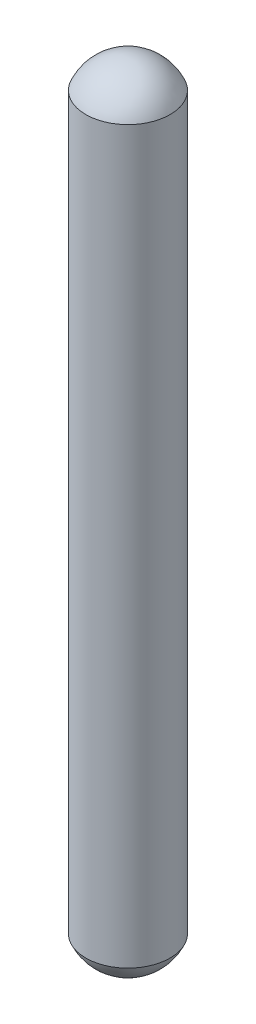
ISO-10303-21;
HEADER;
FILE_DESCRIPTION(('STEP AP214'),'2;1');
FILE_NAME('part.step','',(''),(''),'','','');
FILE_SCHEMA(('AUTOMOTIVE_DESIGN { 1 0 10303 214 1 1 1 1 }'));
ENDSEC;
DATA;
#1=APPLICATION_CONTEXT('core data for automotive mechanical design processes');
#2=APPLICATION_PROTOCOL_DEFINITION('international standard','automotive_design',2000,#1);
#3=PRODUCT_CONTEXT('',#1,'mechanical');
#4=PRODUCT('Part','Part','',(#3));
#5=PRODUCT_RELATED_PRODUCT_CATEGORY('part','',(#4));
#6=PRODUCT_DEFINITION_FORMATION('','',#4);
#7=PRODUCT_DEFINITION_CONTEXT('part definition',#1,'design');
#8=PRODUCT_DEFINITION('design','',#6,#7);
#9=PRODUCT_DEFINITION_SHAPE('','',#8);
#10=(LENGTH_UNIT() NAMED_UNIT(*) SI_UNIT(.MILLI.,.METRE.));
#11=(NAMED_UNIT(*) PLANE_ANGLE_UNIT() SI_UNIT($,.RADIAN.));
#12=(NAMED_UNIT(*) SI_UNIT($,.STERADIAN.) SOLID_ANGLE_UNIT());
#13=UNCERTAINTY_MEASURE_WITH_UNIT(LENGTH_MEASURE(1.E-05),#10,'distance_accuracy_value','');
#14=(GEOMETRIC_REPRESENTATION_CONTEXT(3) GLOBAL_UNCERTAINTY_ASSIGNED_CONTEXT((#13)) GLOBAL_UNIT_ASSIGNED_CONTEXT((#10,
#11,#12)) REPRESENTATION_CONTEXT('',''));
#15=CARTESIAN_POINT('',(0.,0.,0.));
#16=DIRECTION('',(0.,0.,1.));
#17=DIRECTION('',(1.,0.,0.));
#18=AXIS2_PLACEMENT_3D('',#15,#16,#17);
#19=CARTESIAN_POINT('',(0.,52.,0.));
#20=DIRECTION('',(0.,-1.,0.));
#21=DIRECTION('',(0.,0.,-1.));
#22=AXIS2_PLACEMENT_3D('',#19,#20,#21);
#23=CYLINDRICAL_SURFACE('',#22,3.);
#24=CARTESIAN_POINT('',(0.,52.,0.));
#25=DIRECTION('',(0.,1.,0.));
#26=DIRECTION('',(0.,0.,1.));
#27=AXIS2_PLACEMENT_3D('',#24,#25,#26);
#28=CIRCLE('',#27,3.);
#29=CARTESIAN_POINT('',(0.,52.,3.));
#30=VERTEX_POINT('',#29);
#31=EDGE_CURVE('E10',#30,#30,#28,.T.);
#32=ORIENTED_EDGE('',*,*,#31,.F.);
#33=EDGE_LOOP('',(#32));
#34=FACE_BOUND('',#33,.T.);
#35=CARTESIAN_POINT('',(0.,0.,0.));
#36=DIRECTION('',(0.,1.,0.));
#37=DIRECTION('',(0.,0.,1.));
#38=AXIS2_PLACEMENT_3D('',#35,#36,#37);
#39=CIRCLE('',#38,3.);
#40=CARTESIAN_POINT('',(0.,0.,3.));
#41=VERTEX_POINT('',#40);
#42=EDGE_CURVE('E35',#41,#41,#39,.T.);
#43=ORIENTED_EDGE('',*,*,#42,.T.);
#44=EDGE_LOOP('',(#43));
#45=FACE_BOUND('',#44,.T.);
#46=ADVANCED_FACE('F31',(#34,#45),#23,.T.);
#47=CARTESIAN_POINT('',(0.,50.75,0.));
#48=DIRECTION('',(0.,0.,1.));
#49=DIRECTION('',(1.,0.,0.));
#50=AXIS2_PLACEMENT_3D('',#47,#48,#49);
#51=SPHERICAL_SURFACE('',#50,3.25);
#52=CARTESIAN_POINT('',(0.,50.75,0.));
#53=DIRECTION('',(0.,1.,0.));
#54=DIRECTION('',(0.,0.,1.));
#55=AXIS2_PLACEMENT_3D('',#52,#53,#54);
#56=SPHERICAL_SURFACE('',#55,3.25);
#57=ORIENTED_EDGE('',*,*,#31,.T.);
#58=EDGE_LOOP('',(#57));
#59=FACE_BOUND('',#58,.T.);
#60=ADVANCED_FACE('F46',(#59),#56,.T.);
#61=CARTESIAN_POINT('',(0.,1.25,0.));
#62=DIRECTION('',(0.,0.,1.));
#63=DIRECTION('',(1.,0.,0.));
#64=AXIS2_PLACEMENT_3D('',#61,#62,#63);
#65=SPHERICAL_SURFACE('',#64,3.25);
#66=CARTESIAN_POINT('',(0.,1.25,0.));
#67=DIRECTION('',(0.,1.,0.));
#68=DIRECTION('',(0.,0.,1.));
#69=AXIS2_PLACEMENT_3D('',#66,#67,#68);
#70=SPHERICAL_SURFACE('',#69,3.25);
#71=ORIENTED_EDGE('',*,*,#42,.F.);
#72=EDGE_LOOP('',(#71));
#73=FACE_BOUND('',#72,.T.);
#74=ADVANCED_FACE('F33',(#73),#70,.T.);
#75=CLOSED_SHELL('',(#46,#60,#74));
#76=MANIFOLD_SOLID_BREP('B2',#75);
#77=ADVANCED_BREP_SHAPE_REPRESENTATION('',(#18,#76),#14);
#78=SHAPE_DEFINITION_REPRESENTATION(#9,#77);
ENDSEC;
END-ISO-10303-21;
